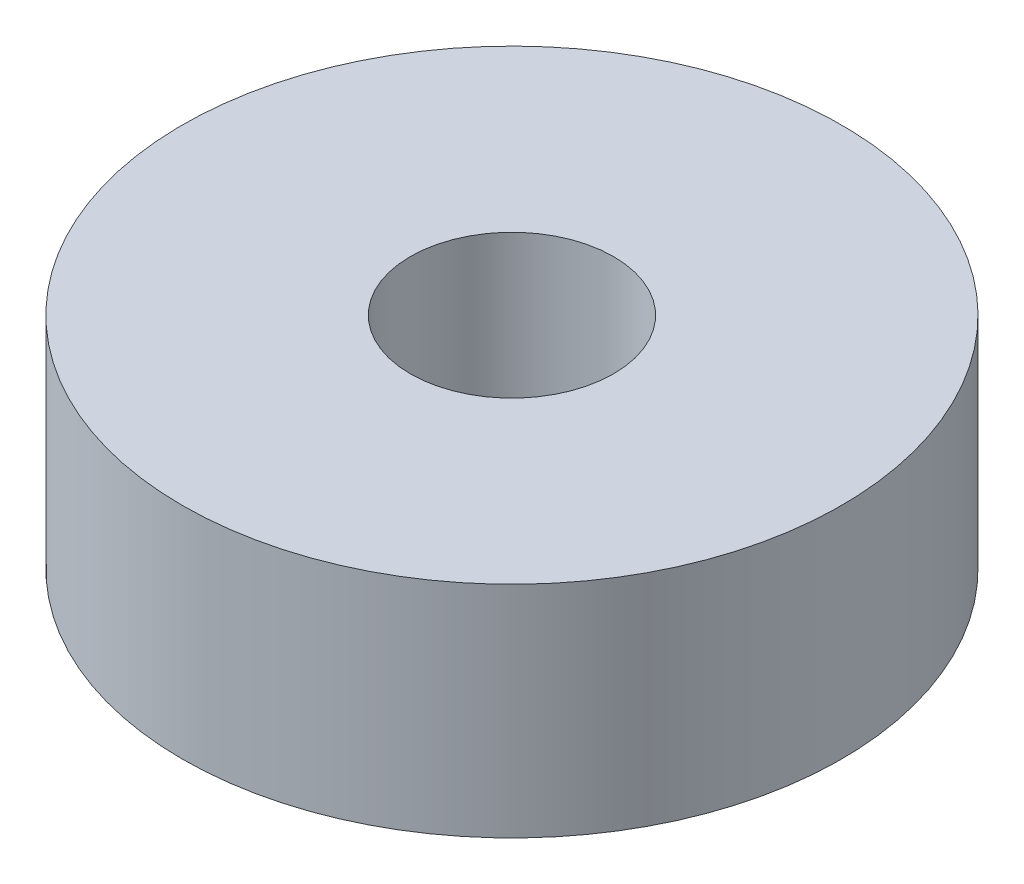
ISO-10303-21;
HEADER;
FILE_DESCRIPTION(('STEP AP214'),'2;1');
FILE_NAME('part.step','',(''),(''),'','','');
FILE_SCHEMA(('AUTOMOTIVE_DESIGN { 1 0 10303 214 1 1 1 1 }'));
ENDSEC;
DATA;
#1=APPLICATION_CONTEXT('core data for automotive mechanical design processes');
#2=APPLICATION_PROTOCOL_DEFINITION('international standard','automotive_design',2000,#1);
#3=PRODUCT_CONTEXT('',#1,'mechanical');
#4=PRODUCT('Part','Part','',(#3));
#5=PRODUCT_RELATED_PRODUCT_CATEGORY('part','',(#4));
#6=PRODUCT_DEFINITION_FORMATION('','',#4);
#7=PRODUCT_DEFINITION_CONTEXT('part definition',#1,'design');
#8=PRODUCT_DEFINITION('design','',#6,#7);
#9=PRODUCT_DEFINITION_SHAPE('','',#8);
#10=(LENGTH_UNIT() NAMED_UNIT(*) SI_UNIT(.MILLI.,.METRE.));
#11=(NAMED_UNIT(*) PLANE_ANGLE_UNIT() SI_UNIT($,.RADIAN.));
#12=(NAMED_UNIT(*) SI_UNIT($,.STERADIAN.) SOLID_ANGLE_UNIT());
#13=UNCERTAINTY_MEASURE_WITH_UNIT(LENGTH_MEASURE(1.E-05),#10,'distance_accuracy_value','');
#14=(GEOMETRIC_REPRESENTATION_CONTEXT(3) GLOBAL_UNCERTAINTY_ASSIGNED_CONTEXT((#13)) GLOBAL_UNIT_ASSIGNED_CONTEXT((#10,
#11,#12)) REPRESENTATION_CONTEXT('',''));
#15=CARTESIAN_POINT('',(0.,0.,0.));
#16=DIRECTION('',(0.,0.,1.));
#17=DIRECTION('',(1.,0.,0.));
#18=AXIS2_PLACEMENT_3D('',#15,#16,#17);
#19=CARTESIAN_POINT('',(0.,2.,0.));
#20=DIRECTION('',(0.,1.,0.));
#21=DIRECTION('',(0.,0.,1.));
#22=AXIS2_PLACEMENT_3D('',#19,#20,#21);
#23=PLANE('',#22);
#24=CARTESIAN_POINT('',(0.,2.,0.));
#25=DIRECTION('',(0.,1.,0.));
#26=DIRECTION('',(0.,0.,1.));
#27=AXIS2_PLACEMENT_3D('',#24,#25,#26);
#28=CIRCLE('',#27,6.);
#29=CARTESIAN_POINT('',(0.,2.,6.));
#30=VERTEX_POINT('',#29);
#31=EDGE_CURVE('E10',#30,#30,#28,.T.);
#32=ORIENTED_EDGE('',*,*,#31,.T.);
#33=EDGE_LOOP('',(#32));
#34=FACE_BOUND('',#33,.T.);
#35=CARTESIAN_POINT('',(0.,2.,0.));
#36=DIRECTION('',(0.,1.,0.));
#37=DIRECTION('',(0.,0.,1.));
#38=AXIS2_PLACEMENT_3D('',#35,#36,#37);
#39=CIRCLE('',#38,1.85);
#40=CARTESIAN_POINT('',(0.,2.,1.85));
#41=VERTEX_POINT('',#40);
#42=EDGE_CURVE('E50',#41,#41,#39,.T.);
#43=ORIENTED_EDGE('',*,*,#42,.F.);
#44=EDGE_LOOP('',(#43));
#45=FACE_BOUND('',#44,.T.);
#46=ADVANCED_FACE('F39',(#34,#45),#23,.T.);
#47=CARTESIAN_POINT('',(0.,-2.,0.));
#48=DIRECTION('',(0.,1.,0.));
#49=DIRECTION('',(0.,0.,1.));
#50=AXIS2_PLACEMENT_3D('',#47,#48,#49);
#51=PLANE('',#50);
#52=CARTESIAN_POINT('',(0.,-2.,0.));
#53=DIRECTION('',(0.,1.,0.));
#54=DIRECTION('',(0.,0.,1.));
#55=AXIS2_PLACEMENT_3D('',#52,#53,#54);
#56=CIRCLE('',#55,6.);
#57=CARTESIAN_POINT('',(0.,-2.,6.));
#58=VERTEX_POINT('',#57);
#59=EDGE_CURVE('E43',#58,#58,#56,.T.);
#60=ORIENTED_EDGE('',*,*,#59,.F.);
#61=EDGE_LOOP('',(#60));
#62=FACE_BOUND('',#61,.T.);
#63=CARTESIAN_POINT('',(0.,-2.,0.));
#64=DIRECTION('',(0.,1.,0.));
#65=DIRECTION('',(0.,0.,1.));
#66=AXIS2_PLACEMENT_3D('',#63,#64,#65);
#67=CIRCLE('',#66,1.85);
#68=CARTESIAN_POINT('',(0.,-2.,1.85));
#69=VERTEX_POINT('',#68);
#70=EDGE_CURVE('E52',#69,#69,#67,.T.);
#71=ORIENTED_EDGE('',*,*,#70,.T.);
#72=EDGE_LOOP('',(#71));
#73=FACE_BOUND('',#72,.T.);
#74=ADVANCED_FACE('F62',(#62,#73),#51,.F.);
#75=CARTESIAN_POINT('',(0.,2.,0.));
#76=DIRECTION('',(0.,-1.,0.));
#77=DIRECTION('',(0.,0.,-1.));
#78=AXIS2_PLACEMENT_3D('',#75,#76,#77);
#79=CYLINDRICAL_SURFACE('',#78,6.);
#80=ORIENTED_EDGE('',*,*,#31,.F.);
#81=EDGE_LOOP('',(#80));
#82=FACE_BOUND('',#81,.T.);
#83=ORIENTED_EDGE('',*,*,#59,.T.);
#84=EDGE_LOOP('',(#83));
#85=FACE_BOUND('',#84,.T.);
#86=ADVANCED_FACE('F41',(#82,#85),#79,.T.);
#87=CARTESIAN_POINT('',(0.,2.,0.));
#88=DIRECTION('',(0.,-1.,0.));
#89=DIRECTION('',(0.,0.,-1.));
#90=AXIS2_PLACEMENT_3D('',#87,#88,#89);
#91=CYLINDRICAL_SURFACE('',#90,1.85);
#92=ORIENTED_EDGE('',*,*,#42,.T.);
#93=EDGE_LOOP('',(#92));
#94=FACE_BOUND('',#93,.T.);
#95=ORIENTED_EDGE('',*,*,#70,.F.);
#96=EDGE_LOOP('',(#95));
#97=FACE_BOUND('',#96,.T.);
#98=ADVANCED_FACE('F58',(#94,#97),#91,.F.);
#99=CLOSED_SHELL('',(#46,#74,#86,#98));
#100=MANIFOLD_SOLID_BREP('B2',#99);
#101=ADVANCED_BREP_SHAPE_REPRESENTATION('',(#18,#100),#14);
#102=SHAPE_DEFINITION_REPRESENTATION(#9,#101);
ENDSEC;
END-ISO-10303-21;
